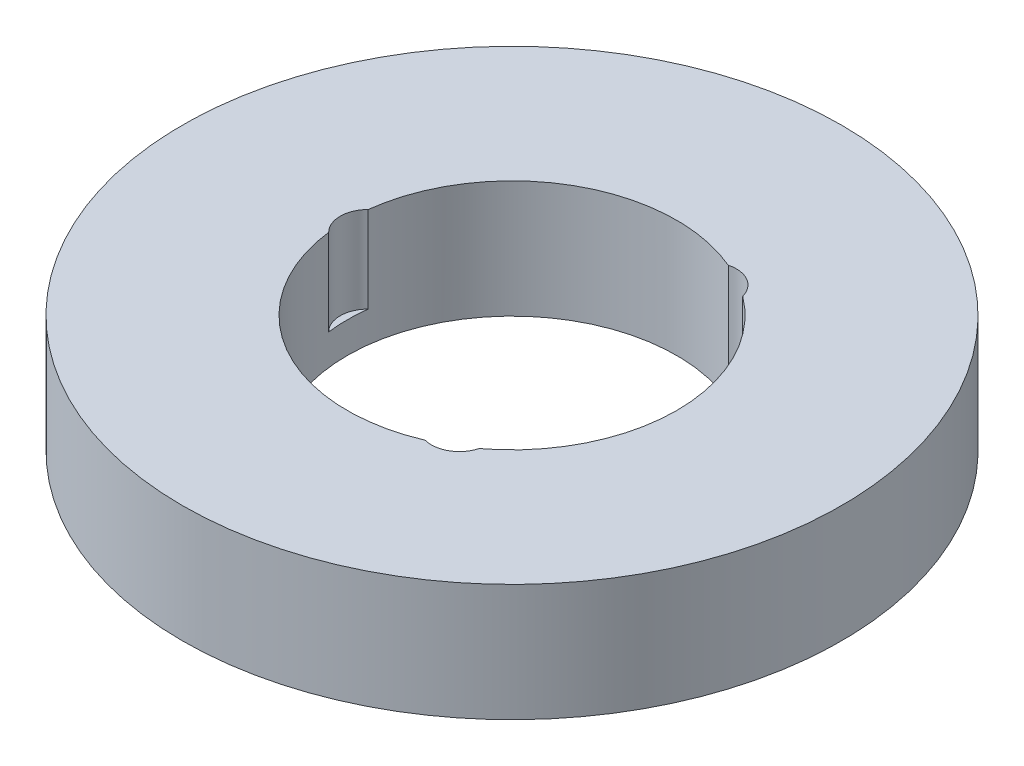
ISO-10303-21;
HEADER;
FILE_DESCRIPTION(('STEP AP214'),'2;1');
FILE_NAME('part.step','',(''),(''),'','','');
FILE_SCHEMA(('AUTOMOTIVE_DESIGN { 1 0 10303 214 1 1 1 1 }'));
ENDSEC;
DATA;
#1=APPLICATION_CONTEXT('core data for automotive mechanical design processes');
#2=APPLICATION_PROTOCOL_DEFINITION('international standard','automotive_design',2000,#1);
#3=PRODUCT_CONTEXT('',#1,'mechanical');
#4=PRODUCT('Part','Part','',(#3));
#5=PRODUCT_RELATED_PRODUCT_CATEGORY('part','',(#4));
#6=PRODUCT_DEFINITION_FORMATION('','',#4);
#7=PRODUCT_DEFINITION_CONTEXT('part definition',#1,'design');
#8=PRODUCT_DEFINITION('design','',#6,#7);
#9=PRODUCT_DEFINITION_SHAPE('','',#8);
#10=(LENGTH_UNIT() NAMED_UNIT(*) SI_UNIT(.MILLI.,.METRE.));
#11=(NAMED_UNIT(*) PLANE_ANGLE_UNIT() SI_UNIT($,.RADIAN.));
#12=(NAMED_UNIT(*) SI_UNIT($,.STERADIAN.) SOLID_ANGLE_UNIT());
#13=UNCERTAINTY_MEASURE_WITH_UNIT(LENGTH_MEASURE(1.E-05),#10,'distance_accuracy_value','');
#14=(GEOMETRIC_REPRESENTATION_CONTEXT(3) GLOBAL_UNCERTAINTY_ASSIGNED_CONTEXT((#13)) GLOBAL_UNIT_ASSIGNED_CONTEXT((#10,
#11,#12)) REPRESENTATION_CONTEXT('',''));
#15=CARTESIAN_POINT('',(0.,0.,0.));
#16=DIRECTION('',(0.,0.,1.));
#17=DIRECTION('',(1.,0.,0.));
#18=AXIS2_PLACEMENT_3D('',#15,#16,#17);
#19=CARTESIAN_POINT('',(0.,16.,0.));
#20=DIRECTION('',(0.,-1.,0.));
#21=DIRECTION('',(0.,0.,-1.));
#22=AXIS2_PLACEMENT_3D('',#19,#20,#21);
#23=CYLINDRICAL_SURFACE('',#22,45.);
#24=CARTESIAN_POINT('',(0.,16.,0.));
#25=DIRECTION('',(0.,1.,0.));
#26=DIRECTION('',(0.,0.,1.));
#27=AXIS2_PLACEMENT_3D('',#24,#25,#26);
#28=CIRCLE('',#27,45.);
#29=CARTESIAN_POINT('',(0.,16.,45.));
#30=VERTEX_POINT('',#29);
#31=EDGE_CURVE('E130',#30,#30,#28,.T.);
#32=ORIENTED_EDGE('',*,*,#31,.F.);
#33=EDGE_LOOP('',(#32));
#34=FACE_BOUND('',#33,.T.);
#35=CARTESIAN_POINT('',(0.,0.,0.));
#36=DIRECTION('',(0.,1.,0.));
#37=DIRECTION('',(0.,0.,1.));
#38=AXIS2_PLACEMENT_3D('',#35,#36,#37);
#39=CIRCLE('',#38,45.);
#40=CARTESIAN_POINT('',(0.,0.,45.));
#41=VERTEX_POINT('',#40);
#42=EDGE_CURVE('E117',#41,#41,#39,.T.);
#43=ORIENTED_EDGE('',*,*,#42,.T.);
#44=EDGE_LOOP('',(#43));
#45=FACE_BOUND('',#44,.T.);
#46=ADVANCED_FACE('F39',(#34,#45),#23,.T.);
#47=CARTESIAN_POINT('',(0.,16.,0.));
#48=DIRECTION('',(0.,1.,0.));
#49=DIRECTION('',(0.,0.,1.));
#50=AXIS2_PLACEMENT_3D('',#47,#48,#49);
#51=PLANE('',#50);
#52=CARTESIAN_POINT('',(9.82445488360305,16.,17.0164550150685));
#53=DIRECTION('',(0.,1.,0.));
#54=DIRECTION('',(0.866025403784436,0.,-0.500000000000004));
#55=AXIS2_PLACEMENT_3D('',#52,#53,#54);
#56=CIRCLE('',#55,3.80603685382938);
#57=CARTESIAN_POINT('',(8.83671200323998,16.,20.6920883666148));
#58=VERTEX_POINT('',#57);
#59=CARTESIAN_POINT('',(13.501518181221,16.,17.99886126404));
#60=VERTEX_POINT('',#59);
#61=EDGE_CURVE('E148',#58,#60,#56,.T.);
#62=ORIENTED_EDGE('',*,*,#61,.F.);
#63=CARTESIAN_POINT('',(0.,16.,0.));
#64=DIRECTION('',(0.,1.,0.));
#65=DIRECTION('',(0.,0.,1.));
#66=AXIS2_PLACEMENT_3D('',#63,#64,#65);
#67=CIRCLE('',#66,22.5);
#68=CARTESIAN_POINT('',(-22.3382301844608,16.,2.69322710257479));
#69=VERTEX_POINT('',#68);
#70=EDGE_CURVE('E113',#69,#58,#67,.T.);
#71=ORIENTED_EDGE('',*,*,#70,.F.);
#72=CARTESIAN_POINT('',(-19.6489097672059,16.,0.));
#73=DIRECTION('',(0.,1.,0.));
#74=DIRECTION('',(0.,0.,1.));
#75=AXIS2_PLACEMENT_3D('',#72,#73,#74);
#76=CIRCLE('',#75,3.80603685382938);
#77=CARTESIAN_POINT('',(-22.3382301844608,16.,-2.69322710257479));
#78=VERTEX_POINT('',#77);
#79=EDGE_CURVE('E125',#78,#69,#76,.T.);
#80=ORIENTED_EDGE('',*,*,#79,.F.);
#81=CARTESIAN_POINT('',(8.8367120032397,16.,-20.6920883666149));
#82=VERTEX_POINT('',#81);
#83=EDGE_CURVE('E107',#82,#78,#67,.T.);
#84=ORIENTED_EDGE('',*,*,#83,.F.);
#85=CARTESIAN_POINT('',(9.82445488360281,16.,-17.0164550150686));
#86=DIRECTION('',(0.,1.,0.));
#87=DIRECTION('',(-0.866025403784443,0.,-0.499999999999992));
#88=AXIS2_PLACEMENT_3D('',#85,#86,#87);
#89=CIRCLE('',#88,3.80603685382938);
#90=CARTESIAN_POINT('',(13.5015181812208,16.,-17.9988612640402));
#91=VERTEX_POINT('',#90);
#92=EDGE_CURVE('E95',#91,#82,#89,.T.);
#93=ORIENTED_EDGE('',*,*,#92,.F.);
#94=EDGE_CURVE('E106',#60,#91,#67,.T.);
#95=ORIENTED_EDGE('',*,*,#94,.F.);
#96=EDGE_LOOP('',(#62,#71,#80,#84,#93,#95));
#97=FACE_BOUND('',#96,.T.);
#98=ORIENTED_EDGE('',*,*,#31,.T.);
#99=EDGE_LOOP('',(#98));
#100=FACE_BOUND('',#99,.T.);
#101=ADVANCED_FACE('F102',(#97,#100),#51,.T.);
#102=CARTESIAN_POINT('',(0.,0.,0.));
#103=DIRECTION('',(0.,1.,0.));
#104=DIRECTION('',(0.,0.,1.));
#105=AXIS2_PLACEMENT_3D('',#102,#103,#104);
#106=PLANE('',#105);
#107=CARTESIAN_POINT('',(0.,0.,0.));
#108=DIRECTION('',(0.,1.,0.));
#109=DIRECTION('',(0.,0.,1.));
#110=AXIS2_PLACEMENT_3D('',#107,#108,#109);
#111=CIRCLE('',#110,22.5);
#112=CARTESIAN_POINT('',(0.,0.,22.5));
#113=VERTEX_POINT('',#112);
#114=EDGE_CURVE('E118',#113,#113,#111,.T.);
#115=ORIENTED_EDGE('',*,*,#114,.T.);
#116=EDGE_LOOP('',(#115));
#117=FACE_BOUND('',#116,.T.);
#118=ORIENTED_EDGE('',*,*,#42,.F.);
#119=EDGE_LOOP('',(#118));
#120=FACE_BOUND('',#119,.T.);
#121=ADVANCED_FACE('F161',(#117,#120),#106,.F.);
#122=CARTESIAN_POINT('',(0.,16.,0.));
#123=DIRECTION('',(0.,-1.,0.));
#124=DIRECTION('',(0.,0.,-1.));
#125=AXIS2_PLACEMENT_3D('',#122,#123,#124);
#126=CYLINDRICAL_SURFACE('',#125,22.5);
#127=DIRECTION('',(0.,1.,0.));
#128=VECTOR('',#127,1.);
#129=CARTESIAN_POINT('',(8.83671200323999,10.1127917406513,20.6920883666148));
#130=LINE('',#129,#128);
#131=CARTESIAN_POINT('',(8.83671200323998,4.22558348130262,20.6920883666148));
#132=VERTEX_POINT('',#131);
#133=EDGE_CURVE('E11',#132,#58,#130,.T.);
#134=ORIENTED_EDGE('',*,*,#133,.F.);
#135=CARTESIAN_POINT('',(0.,4.22558348130262,0.));
#136=DIRECTION('',(0.,1.,0.));
#137=DIRECTION('',(0.,0.,1.));
#138=AXIS2_PLACEMENT_3D('',#135,#136,#137);
#139=CIRCLE('',#138,22.5);
#140=CARTESIAN_POINT('',(13.501518181221,4.22558348130262,17.99886126404));
#141=VERTEX_POINT('',#140);
#142=EDGE_CURVE('E100',#132,#141,#139,.T.);
#143=ORIENTED_EDGE('',*,*,#142,.T.);
#144=DIRECTION('',(0.,1.,0.));
#145=VECTOR('',#144,1.);
#146=CARTESIAN_POINT('',(13.501518181221,10.1127917406513,17.99886126404));
#147=LINE('',#146,#145);
#148=EDGE_CURVE('E46',#60,#141,#147,.F.);
#149=ORIENTED_EDGE('',*,*,#148,.F.);
#150=ORIENTED_EDGE('',*,*,#94,.T.);
#151=DIRECTION('',(0.,1.,0.));
#152=VECTOR('',#151,1.);
#153=CARTESIAN_POINT('',(13.5015181812208,10.1127917406513,-17.9988612640402));
#154=LINE('',#153,#152);
#155=CARTESIAN_POINT('',(13.5015181812208,4.22558348130262,-17.9988612640402));
#156=VERTEX_POINT('',#155);
#157=EDGE_CURVE('E90',#156,#91,#154,.T.);
#158=ORIENTED_EDGE('',*,*,#157,.F.);
#159=CARTESIAN_POINT('',(0.,4.22558348130262,0.));
#160=DIRECTION('',(0.,1.,0.));
#161=DIRECTION('',(0.,0.,1.));
#162=AXIS2_PLACEMENT_3D('',#159,#160,#161);
#163=CIRCLE('',#162,22.5);
#164=CARTESIAN_POINT('',(8.8367120032397,4.22558348130262,-20.6920883666149));
#165=VERTEX_POINT('',#164);
#166=EDGE_CURVE('E143',#156,#165,#163,.T.);
#167=ORIENTED_EDGE('',*,*,#166,.T.);
#168=DIRECTION('',(0.,1.,0.));
#169=VECTOR('',#168,1.);
#170=CARTESIAN_POINT('',(8.83671200323972,10.1127917406513,-20.6920883666149));
#171=LINE('',#170,#169);
#172=EDGE_CURVE('E98',#82,#165,#171,.F.);
#173=ORIENTED_EDGE('',*,*,#172,.F.);
#174=ORIENTED_EDGE('',*,*,#83,.T.);
#175=DIRECTION('',(0.,1.,0.));
#176=VECTOR('',#175,1.);
#177=CARTESIAN_POINT('',(-22.3382301844608,10.1127917406513,-2.69322710257477));
#178=LINE('',#177,#176);
#179=CARTESIAN_POINT('',(-22.3382301844608,4.22558348130262,-2.69322710257479));
#180=VERTEX_POINT('',#179);
#181=EDGE_CURVE('E137',#180,#78,#178,.T.);
#182=ORIENTED_EDGE('',*,*,#181,.F.);
#183=CARTESIAN_POINT('',(0.,4.22558348130262,0.));
#184=DIRECTION('',(0.,1.,0.));
#185=DIRECTION('',(0.,0.,1.));
#186=AXIS2_PLACEMENT_3D('',#183,#184,#185);
#187=CIRCLE('',#186,22.5);
#188=CARTESIAN_POINT('',(-22.3382301844608,4.22558348130262,2.69322710257479));
#189=VERTEX_POINT('',#188);
#190=EDGE_CURVE('E128',#180,#189,#187,.T.);
#191=ORIENTED_EDGE('',*,*,#190,.T.);
#192=DIRECTION('',(0.,1.,0.));
#193=VECTOR('',#192,1.);
#194=CARTESIAN_POINT('',(-22.3382301844608,10.1127917406513,2.69322710257477));
#195=LINE('',#194,#193);
#196=EDGE_CURVE('E134',#69,#189,#195,.F.);
#197=ORIENTED_EDGE('',*,*,#196,.F.);
#198=ORIENTED_EDGE('',*,*,#70,.T.);
#199=EDGE_LOOP('',(#134,#143,#149,#150,#158,#167,#173,#174,#182,#191,#197,#198));
#200=FACE_BOUND('',#199,.T.);
#201=ORIENTED_EDGE('',*,*,#114,.F.);
#202=EDGE_LOOP('',(#201));
#203=FACE_BOUND('',#202,.T.);
#204=ADVANCED_FACE('F115',(#200,#203),#126,.F.);
#205=CARTESIAN_POINT('',(-19.6489097672059,4.22558348130262,0.));
#206=DIRECTION('',(0.,1.,0.));
#207=DIRECTION('',(0.,0.,1.));
#208=AXIS2_PLACEMENT_3D('',#205,#206,#207);
#209=CYLINDRICAL_SURFACE('',#208,3.80603685382938);
#210=ORIENTED_EDGE('',*,*,#181,.T.);
#211=ORIENTED_EDGE('',*,*,#79,.T.);
#212=ORIENTED_EDGE('',*,*,#196,.T.);
#213=CARTESIAN_POINT('',(-19.6489097672059,4.22558348130262,0.));
#214=DIRECTION('',(0.,1.,0.));
#215=DIRECTION('',(0.,0.,1.));
#216=AXIS2_PLACEMENT_3D('',#213,#214,#215);
#217=CIRCLE('',#216,3.80603685382938);
#218=EDGE_CURVE('E127',#180,#189,#217,.T.);
#219=ORIENTED_EDGE('',*,*,#218,.F.);
#220=EDGE_LOOP('',(#210,#211,#212,#219));
#221=FACE_BOUND('',#220,.T.);
#222=ADVANCED_FACE('F175',(#221),#209,.F.);
#223=CARTESIAN_POINT('',(-19.6489097672059,4.22558348130262,0.));
#224=DIRECTION('',(0.,1.,0.));
#225=DIRECTION('',(0.,0.,1.));
#226=AXIS2_PLACEMENT_3D('',#223,#224,#225);
#227=PLANE('',#226);
#228=ORIENTED_EDGE('',*,*,#218,.T.);
#229=ORIENTED_EDGE('',*,*,#190,.F.);
#230=EDGE_LOOP('',(#228,#229));
#231=FACE_BOUND('',#230,.T.);
#232=ADVANCED_FACE('F176',(#231),#227,.T.);
#233=CARTESIAN_POINT('',(9.82445488360281,4.22558348130262,-17.0164550150686));
#234=DIRECTION('',(0.,1.,0.));
#235=DIRECTION('',(0.,0.,1.));
#236=AXIS2_PLACEMENT_3D('',#233,#234,#235);
#237=CYLINDRICAL_SURFACE('',#236,3.80603685382938);
#238=ORIENTED_EDGE('',*,*,#157,.T.);
#239=ORIENTED_EDGE('',*,*,#92,.T.);
#240=ORIENTED_EDGE('',*,*,#172,.T.);
#241=CARTESIAN_POINT('',(9.82445488360281,4.22558348130262,-17.0164550150686));
#242=DIRECTION('',(0.,1.,0.));
#243=DIRECTION('',(-0.866025403784443,0.,-0.499999999999992));
#244=AXIS2_PLACEMENT_3D('',#241,#242,#243);
#245=CIRCLE('',#244,3.80603685382938);
#246=EDGE_CURVE('E56',#156,#165,#245,.T.);
#247=ORIENTED_EDGE('',*,*,#246,.F.);
#248=EDGE_LOOP('',(#238,#239,#240,#247));
#249=FACE_BOUND('',#248,.T.);
#250=ADVANCED_FACE('F93',(#249),#237,.F.);
#251=CARTESIAN_POINT('',(9.82445488360281,4.22558348130262,-17.0164550150686));
#252=DIRECTION('',(0.,1.,0.));
#253=DIRECTION('',(-0.866025403784443,0.,-0.499999999999992));
#254=AXIS2_PLACEMENT_3D('',#251,#252,#253);
#255=PLANE('',#254);
#256=ORIENTED_EDGE('',*,*,#246,.T.);
#257=ORIENTED_EDGE('',*,*,#166,.F.);
#258=EDGE_LOOP('',(#256,#257));
#259=FACE_BOUND('',#258,.T.);
#260=ADVANCED_FACE('F153',(#259),#255,.T.);
#261=CARTESIAN_POINT('',(9.82445488360305,4.22558348130262,17.0164550150685));
#262=DIRECTION('',(0.,1.,0.));
#263=DIRECTION('',(0.,0.,1.));
#264=AXIS2_PLACEMENT_3D('',#261,#262,#263);
#265=CYLINDRICAL_SURFACE('',#264,3.80603685382938);
#266=ORIENTED_EDGE('',*,*,#133,.T.);
#267=ORIENTED_EDGE('',*,*,#61,.T.);
#268=ORIENTED_EDGE('',*,*,#148,.T.);
#269=CARTESIAN_POINT('',(9.82445488360305,4.22558348130262,17.0164550150685));
#270=DIRECTION('',(0.,1.,0.));
#271=DIRECTION('',(0.866025403784436,0.,-0.500000000000004));
#272=AXIS2_PLACEMENT_3D('',#269,#270,#271);
#273=CIRCLE('',#272,3.80603685382938);
#274=EDGE_CURVE('E55',#132,#141,#273,.T.);
#275=ORIENTED_EDGE('',*,*,#274,.F.);
#276=EDGE_LOOP('',(#266,#267,#268,#275));
#277=FACE_BOUND('',#276,.T.);
#278=ADVANCED_FACE('F144',(#277),#265,.F.);
#279=CARTESIAN_POINT('',(9.82445488360305,4.22558348130262,17.0164550150685));
#280=DIRECTION('',(0.,1.,0.));
#281=DIRECTION('',(0.866025403784436,0.,-0.500000000000004));
#282=AXIS2_PLACEMENT_3D('',#279,#280,#281);
#283=PLANE('',#282);
#284=ORIENTED_EDGE('',*,*,#274,.T.);
#285=ORIENTED_EDGE('',*,*,#142,.F.);
#286=EDGE_LOOP('',(#284,#285));
#287=FACE_BOUND('',#286,.T.);
#288=ADVANCED_FACE('F150',(#287),#283,.T.);
#289=CLOSED_SHELL('',(#46,#101,#121,#204,#222,#232,#250,#260,#278,#288));
#290=MANIFOLD_SOLID_BREP('B2',#289);
#291=ADVANCED_BREP_SHAPE_REPRESENTATION('',(#18,#290),#14);
#292=SHAPE_DEFINITION_REPRESENTATION(#9,#291);
ENDSEC;
END-ISO-10303-21;
